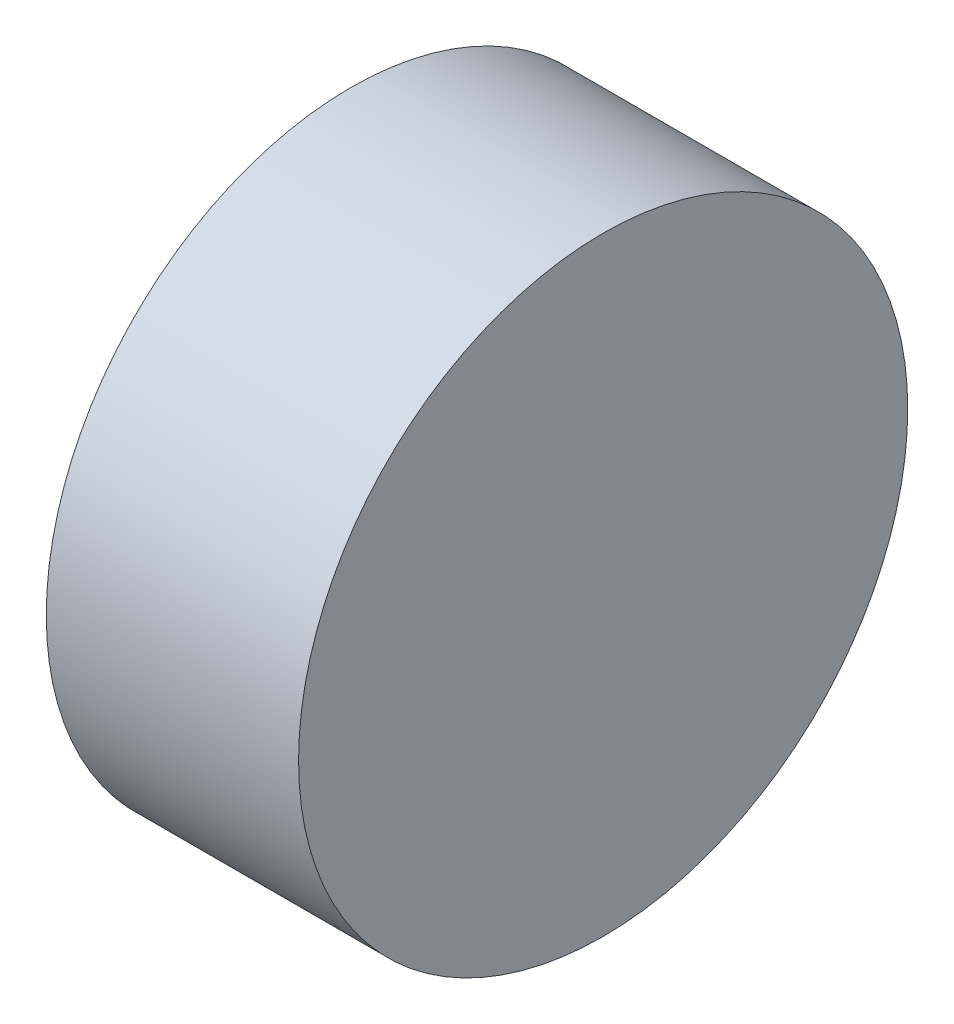
ISO-10303-21;
HEADER;
FILE_DESCRIPTION(('STEP AP214'),'2;1');
FILE_NAME('part.step','',(''),(''),'','','');
FILE_SCHEMA(('AUTOMOTIVE_DESIGN { 1 0 10303 214 1 1 1 1 }'));
ENDSEC;
DATA;
#1=APPLICATION_CONTEXT('core data for automotive mechanical design processes');
#2=APPLICATION_PROTOCOL_DEFINITION('international standard','automotive_design',2000,#1);
#3=PRODUCT_CONTEXT('',#1,'mechanical');
#4=PRODUCT('Part','Part','',(#3));
#5=PRODUCT_RELATED_PRODUCT_CATEGORY('part','',(#4));
#6=PRODUCT_DEFINITION_FORMATION('','',#4);
#7=PRODUCT_DEFINITION_CONTEXT('part definition',#1,'design');
#8=PRODUCT_DEFINITION('design','',#6,#7);
#9=PRODUCT_DEFINITION_SHAPE('','',#8);
#10=(LENGTH_UNIT() NAMED_UNIT(*) SI_UNIT(.MILLI.,.METRE.));
#11=(NAMED_UNIT(*) PLANE_ANGLE_UNIT() SI_UNIT($,.RADIAN.));
#12=(NAMED_UNIT(*) SI_UNIT($,.STERADIAN.) SOLID_ANGLE_UNIT());
#13=UNCERTAINTY_MEASURE_WITH_UNIT(LENGTH_MEASURE(1.E-05),#10,'distance_accuracy_value','');
#14=(GEOMETRIC_REPRESENTATION_CONTEXT(3) GLOBAL_UNCERTAINTY_ASSIGNED_CONTEXT((#13)) GLOBAL_UNIT_ASSIGNED_CONTEXT((#10,
#11,#12)) REPRESENTATION_CONTEXT('',''));
#15=CARTESIAN_POINT('',(0.,0.,0.));
#16=DIRECTION('',(0.,0.,1.));
#17=DIRECTION('',(1.,0.,0.));
#18=AXIS2_PLACEMENT_3D('',#15,#16,#17);
#19=CARTESIAN_POINT('',(61.8961057560749,0.,0.));
#20=DIRECTION('',(1.,0.,0.));
#21=DIRECTION('',(0.,0.,-1.));
#22=AXIS2_PLACEMENT_3D('',#19,#20,#21);
#23=CONICAL_SURFACE('',#22,4.70623591755043E-06,1.56997298607957);
#24=CARTESIAN_POINT('',(61.9013339612769,0.,0.));
#25=DIRECTION('',(-1.,0.,0.));
#26=DIRECTION('',(0.,0.,1.));
#27=AXIS2_PLACEMENT_3D('',#24,#25,#26);
#28=CIRCLE('',#27,6.34999314147005);
#29=CARTESIAN_POINT('',(61.9013339612769,0.,6.34999314147005));
#30=VERTEX_POINT('',#29);
#31=EDGE_CURVE('E11',#30,#30,#28,.T.);
#32=ORIENTED_EDGE('',*,*,#31,.F.);
#33=EDGE_LOOP('',(#32));
#34=FACE_BOUND('',#33,.T.);
#35=CARTESIAN_POINT('',(61.8961057560749,-4.70623591754817E-06,0.));
#36=VERTEX_POINT('',#35);
#37=VERTEX_LOOP('',#36);
#38=FACE_BOUND('',#37,.T.);
#39=ADVANCED_FACE('F32',(#34,#38),#23,.F.);
#40=CARTESIAN_POINT('',(30.3113835376532,0.,0.));
#41=DIRECTION('',(-1.,0.,0.));
#42=DIRECTION('',(0.,0.,1.));
#43=AXIS2_PLACEMENT_3D('',#40,#41,#42);
#44=CYLINDRICAL_SURFACE('',#43,6.34999314147005);
#45=CARTESIAN_POINT('',(56.6413339612769,0.,0.));
#46=DIRECTION('',(-1.,0.,0.));
#47=DIRECTION('',(0.,0.,1.));
#48=AXIS2_PLACEMENT_3D('',#45,#46,#47);
#49=CIRCLE('',#48,6.34999314147005);
#50=CARTESIAN_POINT('',(56.6413339612769,0.,6.34999314147005));
#51=VERTEX_POINT('',#50);
#52=EDGE_CURVE('E39',#51,#51,#49,.T.);
#53=ORIENTED_EDGE('',*,*,#52,.F.);
#54=EDGE_LOOP('',(#53));
#55=FACE_BOUND('',#54,.T.);
#56=ORIENTED_EDGE('',*,*,#31,.T.);
#57=EDGE_LOOP('',(#56));
#58=FACE_BOUND('',#57,.T.);
#59=ADVANCED_FACE('F48',(#55,#58),#44,.T.);
#60=CARTESIAN_POINT('',(52.0861080784988,0.,0.00601827102264942));
#61=DIRECTION('',(0.,-1.,0.));
#62=DIRECTION('',(0.,0.,1.));
#63=AXIS2_PLACEMENT_3D('',#60,#61,#62);
#64=CIRCLE('',#63,7.81);
#65=TRIMMED_CURVE('',#64,(PARAMETER_VALUE(-1.57156691214935)),
(PARAMETER_VALUE(1.57156691214935)),.T.,.PARAMETER.);
#66=CARTESIAN_POINT('',(52.0861080784988,0.,0.));
#67=DIRECTION('',(-1.,0.,0.));
#68=AXIS1_PLACEMENT('',#66,#67);
#69=SURFACE_OF_REVOLUTION('',#65,#68);
#70=CARTESIAN_POINT('',(59.8961057560749,-4.70623591779309E-06,0.));
#71=VERTEX_POINT('',#70);
#72=VERTEX_LOOP('',#71);
#73=FACE_BOUND('',#72,.T.);
#74=ORIENTED_EDGE('',*,*,#52,.T.);
#75=EDGE_LOOP('',(#74));
#76=FACE_BOUND('',#75,.T.);
#77=ADVANCED_FACE('F45',(#73,#76),#69,.F.);
#78=CLOSED_SHELL('',(#39,#59,#77));
#79=MANIFOLD_SOLID_BREP('B2',#78);
#80=ADVANCED_BREP_SHAPE_REPRESENTATION('',(#18,#79),#14);
#81=SHAPE_DEFINITION_REPRESENTATION(#9,#80);
ENDSEC;
END-ISO-10303-21;
